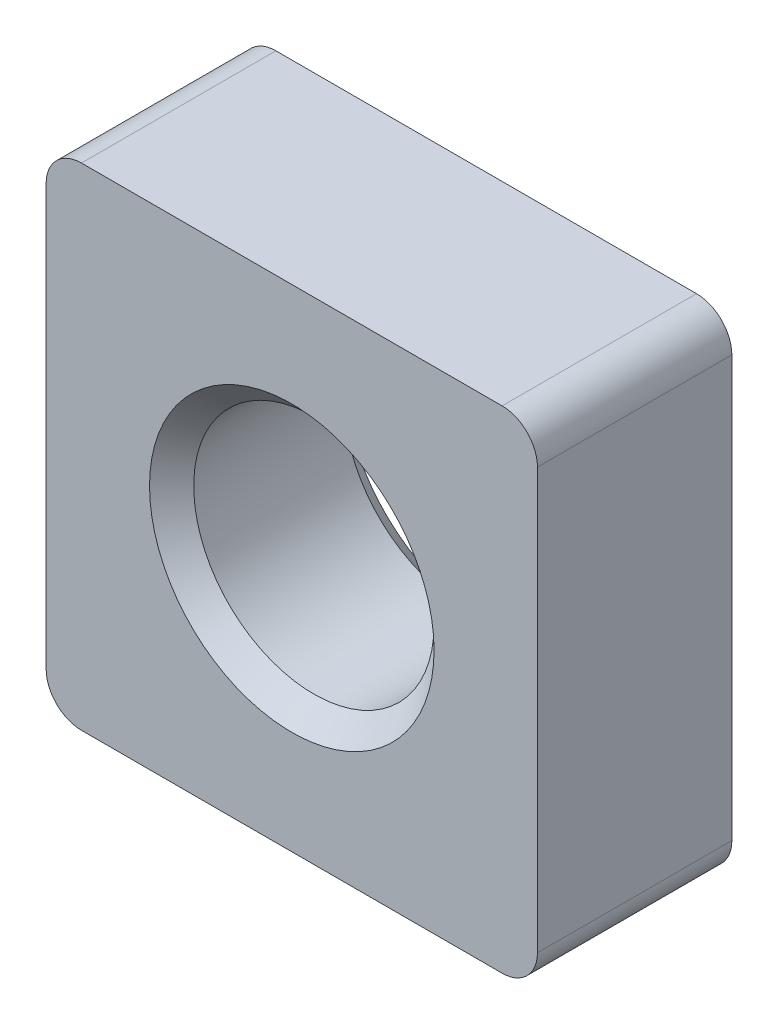
ISO-10303-21;
HEADER;
FILE_DESCRIPTION(('STEP AP214'),'2;1');
FILE_NAME('part.step','',(''),(''),'','','');
FILE_SCHEMA(('AUTOMOTIVE_DESIGN { 1 0 10303 214 1 1 1 1 }'));
ENDSEC;
DATA;
#1=APPLICATION_CONTEXT('core data for automotive mechanical design processes');
#2=APPLICATION_PROTOCOL_DEFINITION('international standard','automotive_design',2000,#1);
#3=PRODUCT_CONTEXT('',#1,'mechanical');
#4=PRODUCT('Part','Part','',(#3));
#5=PRODUCT_RELATED_PRODUCT_CATEGORY('part','',(#4));
#6=PRODUCT_DEFINITION_FORMATION('','',#4);
#7=PRODUCT_DEFINITION_CONTEXT('part definition',#1,'design');
#8=PRODUCT_DEFINITION('design','',#6,#7);
#9=PRODUCT_DEFINITION_SHAPE('','',#8);
#10=(LENGTH_UNIT() NAMED_UNIT(*) SI_UNIT(.MILLI.,.METRE.));
#11=(NAMED_UNIT(*) PLANE_ANGLE_UNIT() SI_UNIT($,.RADIAN.));
#12=(NAMED_UNIT(*) SI_UNIT($,.STERADIAN.) SOLID_ANGLE_UNIT());
#13=UNCERTAINTY_MEASURE_WITH_UNIT(LENGTH_MEASURE(1.E-05),#10,'distance_accuracy_value','');
#14=(GEOMETRIC_REPRESENTATION_CONTEXT(3) GLOBAL_UNCERTAINTY_ASSIGNED_CONTEXT((#13)) GLOBAL_UNIT_ASSIGNED_CONTEXT((#10,
#11,#12)) REPRESENTATION_CONTEXT('',''));
#15=CARTESIAN_POINT('',(0.,0.,0.));
#16=DIRECTION('',(0.,0.,1.));
#17=DIRECTION('',(1.,0.,0.));
#18=AXIS2_PLACEMENT_3D('',#15,#16,#17);
#19=CARTESIAN_POINT('',(6.95,-6.95,5.5));
#20=DIRECTION('',(-1.,0.,0.));
#21=DIRECTION('',(0.,0.,1.));
#22=AXIS2_PLACEMENT_3D('',#19,#20,#21);
#23=PLANE('',#22);
#24=DIRECTION('',(0.,1.,0.));
#25=VECTOR('',#24,1.);
#26=CARTESIAN_POINT('',(6.95,-6.95,0.));
#27=LINE('',#26,#25);
#28=CARTESIAN_POINT('',(6.95,-5.95,0.));
#29=VERTEX_POINT('',#28);
#30=CARTESIAN_POINT('',(6.95,5.95,0.));
#31=VERTEX_POINT('',#30);
#32=EDGE_CURVE('E129',#29,#31,#27,.T.);
#33=ORIENTED_EDGE('',*,*,#32,.T.);
#34=DIRECTION('',(0.,0.,-1.));
#35=VECTOR('',#34,1.);
#36=CARTESIAN_POINT('',(6.95,5.95,5.5));
#37=LINE('',#36,#35);
#38=CARTESIAN_POINT('',(6.95,5.95,5.5));
#39=VERTEX_POINT('',#38);
#40=EDGE_CURVE('E107',#31,#39,#37,.F.);
#41=ORIENTED_EDGE('',*,*,#40,.T.);
#42=DIRECTION('',(0.,1.,0.));
#43=VECTOR('',#42,1.);
#44=CARTESIAN_POINT('',(6.95,-6.95,5.5));
#45=LINE('',#44,#43);
#46=CARTESIAN_POINT('',(6.95,-5.95,5.5));
#47=VERTEX_POINT('',#46);
#48=EDGE_CURVE('E139',#47,#39,#45,.T.);
#49=ORIENTED_EDGE('',*,*,#48,.F.);
#50=DIRECTION('',(0.,0.,-1.));
#51=VECTOR('',#50,1.);
#52=CARTESIAN_POINT('',(6.95,-5.95,5.5));
#53=LINE('',#52,#51);
#54=EDGE_CURVE('E112',#47,#29,#53,.T.);
#55=ORIENTED_EDGE('',*,*,#54,.T.);
#56=EDGE_LOOP('',(#33,#41,#49,#55));
#57=FACE_BOUND('',#56,.T.);
#58=ADVANCED_FACE('F37',(#57),#23,.F.);
#59=CARTESIAN_POINT('',(-6.95,6.95,5.5));
#60=DIRECTION('',(0.,-1.,0.));
#61=DIRECTION('',(0.,0.,-1.));
#62=AXIS2_PLACEMENT_3D('',#59,#60,#61);
#63=PLANE('',#62);
#64=DIRECTION('',(-1.,0.,0.));
#65=VECTOR('',#64,1.);
#66=CARTESIAN_POINT('',(-6.95,6.95,5.5));
#67=LINE('',#66,#65);
#68=CARTESIAN_POINT('',(5.95,6.95,5.5));
#69=VERTEX_POINT('',#68);
#70=CARTESIAN_POINT('',(-5.95,6.95,5.5));
#71=VERTEX_POINT('',#70);
#72=EDGE_CURVE('E122',#69,#71,#67,.T.);
#73=ORIENTED_EDGE('',*,*,#72,.F.);
#74=DIRECTION('',(0.,0.,-1.));
#75=VECTOR('',#74,1.);
#76=CARTESIAN_POINT('',(5.95,6.95,5.5));
#77=LINE('',#76,#75);
#78=CARTESIAN_POINT('',(5.95,6.95,0.));
#79=VERTEX_POINT('',#78);
#80=EDGE_CURVE('E106',#69,#79,#77,.T.);
#81=ORIENTED_EDGE('',*,*,#80,.T.);
#82=DIRECTION('',(-1.,0.,0.));
#83=VECTOR('',#82,1.);
#84=CARTESIAN_POINT('',(-6.95,6.95,0.));
#85=LINE('',#84,#83);
#86=CARTESIAN_POINT('',(-5.95,6.95,0.));
#87=VERTEX_POINT('',#86);
#88=EDGE_CURVE('E119',#79,#87,#85,.T.);
#89=ORIENTED_EDGE('',*,*,#88,.T.);
#90=DIRECTION('',(0.,0.,-1.));
#91=VECTOR('',#90,1.);
#92=CARTESIAN_POINT('',(-5.95,6.95,5.5));
#93=LINE('',#92,#91);
#94=EDGE_CURVE('E124',#87,#71,#93,.F.);
#95=ORIENTED_EDGE('',*,*,#94,.T.);
#96=EDGE_LOOP('',(#73,#81,#89,#95));
#97=FACE_BOUND('',#96,.T.);
#98=ADVANCED_FACE('F118',(#97),#63,.F.);
#99=CARTESIAN_POINT('',(-6.95,-6.95,5.5));
#100=DIRECTION('',(1.,0.,0.));
#101=DIRECTION('',(0.,0.,-1.));
#102=AXIS2_PLACEMENT_3D('',#99,#100,#101);
#103=PLANE('',#102);
#104=DIRECTION('',(0.,-1.,0.));
#105=VECTOR('',#104,1.);
#106=CARTESIAN_POINT('',(-6.95,-6.95,5.5));
#107=LINE('',#106,#105);
#108=CARTESIAN_POINT('',(-6.95,5.95,5.5));
#109=VERTEX_POINT('',#108);
#110=CARTESIAN_POINT('',(-6.95,-5.95,5.5));
#111=VERTEX_POINT('',#110);
#112=EDGE_CURVE('E173',#109,#111,#107,.T.);
#113=ORIENTED_EDGE('',*,*,#112,.F.);
#114=DIRECTION('',(0.,0.,-1.));
#115=VECTOR('',#114,1.);
#116=CARTESIAN_POINT('',(-6.95,5.95,5.5));
#117=LINE('',#116,#115);
#118=CARTESIAN_POINT('',(-6.95,5.95,0.));
#119=VERTEX_POINT('',#118);
#120=EDGE_CURVE('E158',#109,#119,#117,.T.);
#121=ORIENTED_EDGE('',*,*,#120,.T.);
#122=DIRECTION('',(0.,-1.,0.));
#123=VECTOR('',#122,1.);
#124=CARTESIAN_POINT('',(-6.95,-6.95,0.));
#125=LINE('',#124,#123);
#126=CARTESIAN_POINT('',(-6.95,-5.95,0.));
#127=VERTEX_POINT('',#126);
#128=EDGE_CURVE('E128',#119,#127,#125,.T.);
#129=ORIENTED_EDGE('',*,*,#128,.T.);
#130=DIRECTION('',(0.,0.,-1.));
#131=VECTOR('',#130,1.);
#132=CARTESIAN_POINT('',(-6.95,-5.95,5.5));
#133=LINE('',#132,#131);
#134=EDGE_CURVE('E156',#127,#111,#133,.F.);
#135=ORIENTED_EDGE('',*,*,#134,.T.);
#136=EDGE_LOOP('',(#113,#121,#129,#135));
#137=FACE_BOUND('',#136,.T.);
#138=ADVANCED_FACE('F189',(#137),#103,.F.);
#139=CARTESIAN_POINT('',(-6.95,-6.95,5.5));
#140=DIRECTION('',(0.,1.,0.));
#141=DIRECTION('',(0.,0.,1.));
#142=AXIS2_PLACEMENT_3D('',#139,#140,#141);
#143=PLANE('',#142);
#144=DIRECTION('',(1.,0.,0.));
#145=VECTOR('',#144,1.);
#146=CARTESIAN_POINT('',(-6.95,-6.95,0.));
#147=LINE('',#146,#145);
#148=CARTESIAN_POINT('',(-5.95,-6.95,0.));
#149=VERTEX_POINT('',#148);
#150=CARTESIAN_POINT('',(5.95,-6.95,0.));
#151=VERTEX_POINT('',#150);
#152=EDGE_CURVE('E132',#149,#151,#147,.T.);
#153=ORIENTED_EDGE('',*,*,#152,.T.);
#154=DIRECTION('',(0.,0.,-1.));
#155=VECTOR('',#154,1.);
#156=CARTESIAN_POINT('',(5.95,-6.95,5.5));
#157=LINE('',#156,#155);
#158=CARTESIAN_POINT('',(5.95,-6.95,5.5));
#159=VERTEX_POINT('',#158);
#160=EDGE_CURVE('E11',#151,#159,#157,.F.);
#161=ORIENTED_EDGE('',*,*,#160,.T.);
#162=DIRECTION('',(1.,0.,0.));
#163=VECTOR('',#162,1.);
#164=CARTESIAN_POINT('',(-6.95,-6.95,5.5));
#165=LINE('',#164,#163);
#166=CARTESIAN_POINT('',(-5.95,-6.95,5.5));
#167=VERTEX_POINT('',#166);
#168=EDGE_CURVE('E140',#167,#159,#165,.T.);
#169=ORIENTED_EDGE('',*,*,#168,.F.);
#170=DIRECTION('',(0.,0.,-1.));
#171=VECTOR('',#170,1.);
#172=CARTESIAN_POINT('',(-5.95,-6.95,5.5));
#173=LINE('',#172,#171);
#174=EDGE_CURVE('E45',#167,#149,#173,.T.);
#175=ORIENTED_EDGE('',*,*,#174,.T.);
#176=EDGE_LOOP('',(#153,#161,#169,#175));
#177=FACE_BOUND('',#176,.T.);
#178=ADVANCED_FACE('F163',(#177),#143,.F.);
#179=CARTESIAN_POINT('',(0.,0.,5.5));
#180=DIRECTION('',(0.,0.,-1.));
#181=DIRECTION('',(-1.,0.,0.));
#182=AXIS2_PLACEMENT_3D('',#179,#180,#181);
#183=PLANE('',#182);
#184=CARTESIAN_POINT('',(0.,0.,5.5));
#185=DIRECTION('',(0.,0.,1.));
#186=DIRECTION('',(1.,0.,0.));
#187=AXIS2_PLACEMENT_3D('',#184,#185,#186);
#188=CIRCLE('',#187,4.025);
#189=CARTESIAN_POINT('',(4.025,0.,5.5));
#190=VERTEX_POINT('',#189);
#191=EDGE_CURVE('E298',#190,#190,#188,.T.);
#192=ORIENTED_EDGE('',*,*,#191,.F.);
#193=EDGE_LOOP('',(#192));
#194=FACE_BOUND('',#193,.T.);
#195=ORIENTED_EDGE('',*,*,#48,.T.);
#196=CARTESIAN_POINT('',(5.95,5.95,5.5));
#197=DIRECTION('',(0.,0.,-1.));
#198=DIRECTION('',(-1.,0.,0.));
#199=AXIS2_PLACEMENT_3D('',#196,#197,#198);
#200=CIRCLE('',#199,1.);
#201=EDGE_CURVE('E154',#39,#69,#200,.F.);
#202=ORIENTED_EDGE('',*,*,#201,.T.);
#203=ORIENTED_EDGE('',*,*,#72,.T.);
#204=CARTESIAN_POINT('',(-5.95,5.95,5.5));
#205=DIRECTION('',(0.,0.,-1.));
#206=DIRECTION('',(-1.,0.,0.));
#207=AXIS2_PLACEMENT_3D('',#204,#205,#206);
#208=CIRCLE('',#207,1.);
#209=EDGE_CURVE('E152',#71,#109,#208,.F.);
#210=ORIENTED_EDGE('',*,*,#209,.T.);
#211=ORIENTED_EDGE('',*,*,#112,.T.);
#212=CARTESIAN_POINT('',(-5.95,-5.95,5.5));
#213=DIRECTION('',(0.,0.,-1.));
#214=DIRECTION('',(-1.,0.,0.));
#215=AXIS2_PLACEMENT_3D('',#212,#213,#214);
#216=CIRCLE('',#215,1.);
#217=EDGE_CURVE('E57',#111,#167,#216,.F.);
#218=ORIENTED_EDGE('',*,*,#217,.T.);
#219=ORIENTED_EDGE('',*,*,#168,.T.);
#220=CARTESIAN_POINT('',(5.95,-5.95,5.5));
#221=DIRECTION('',(0.,0.,-1.));
#222=DIRECTION('',(-1.,0.,0.));
#223=AXIS2_PLACEMENT_3D('',#220,#221,#222);
#224=CIRCLE('',#223,1.);
#225=EDGE_CURVE('E150',#159,#47,#224,.F.);
#226=ORIENTED_EDGE('',*,*,#225,.T.);
#227=EDGE_LOOP('',(#195,#202,#203,#210,#211,#218,#219,#226));
#228=FACE_BOUND('',#227,.T.);
#229=ADVANCED_FACE('F178',(#194,#228),#183,.F.);
#230=CARTESIAN_POINT('',(0.,0.,0.));
#231=DIRECTION('',(0.,0.,-1.));
#232=DIRECTION('',(-1.,0.,0.));
#233=AXIS2_PLACEMENT_3D('',#230,#231,#232);
#234=PLANE('',#233);
#235=CARTESIAN_POINT('',(0.,0.,0.));
#236=DIRECTION('',(0.,0.,1.));
#237=DIRECTION('',(1.,0.,0.));
#238=AXIS2_PLACEMENT_3D('',#235,#236,#237);
#239=CIRCLE('',#238,4.025);
#240=CARTESIAN_POINT('',(4.025,0.,0.));
#241=VERTEX_POINT('',#240);
#242=EDGE_CURVE('E293',#241,#241,#239,.T.);
#243=ORIENTED_EDGE('',*,*,#242,.T.);
#244=EDGE_LOOP('',(#243));
#245=FACE_BOUND('',#244,.T.);
#246=ORIENTED_EDGE('',*,*,#88,.F.);
#247=CARTESIAN_POINT('',(5.95,5.95,0.));
#248=DIRECTION('',(0.,0.,-1.));
#249=DIRECTION('',(-1.,0.,0.));
#250=AXIS2_PLACEMENT_3D('',#247,#248,#249);
#251=CIRCLE('',#250,1.);
#252=EDGE_CURVE('E102',#79,#31,#251,.T.);
#253=ORIENTED_EDGE('',*,*,#252,.T.);
#254=ORIENTED_EDGE('',*,*,#32,.F.);
#255=CARTESIAN_POINT('',(5.95,-5.95,0.));
#256=DIRECTION('',(0.,0.,-1.));
#257=DIRECTION('',(-1.,0.,0.));
#258=AXIS2_PLACEMENT_3D('',#255,#256,#257);
#259=CIRCLE('',#258,1.);
#260=EDGE_CURVE('E143',#29,#151,#259,.T.);
#261=ORIENTED_EDGE('',*,*,#260,.T.);
#262=ORIENTED_EDGE('',*,*,#152,.F.);
#263=CARTESIAN_POINT('',(-5.95,-5.95,0.));
#264=DIRECTION('',(0.,0.,-1.));
#265=DIRECTION('',(-1.,0.,0.));
#266=AXIS2_PLACEMENT_3D('',#263,#264,#265);
#267=CIRCLE('',#266,1.);
#268=EDGE_CURVE('E123',#149,#127,#267,.T.);
#269=ORIENTED_EDGE('',*,*,#268,.T.);
#270=ORIENTED_EDGE('',*,*,#128,.F.);
#271=CARTESIAN_POINT('',(-5.95,5.95,0.));
#272=DIRECTION('',(0.,0.,-1.));
#273=DIRECTION('',(-1.,0.,0.));
#274=AXIS2_PLACEMENT_3D('',#271,#272,#273);
#275=CIRCLE('',#274,1.);
#276=EDGE_CURVE('E113',#119,#87,#275,.T.);
#277=ORIENTED_EDGE('',*,*,#276,.T.);
#278=EDGE_LOOP('',(#246,#253,#254,#261,#262,#269,#270,#277));
#279=FACE_BOUND('',#278,.T.);
#280=ADVANCED_FACE('F126',(#245,#279),#234,.T.);
#281=CARTESIAN_POINT('',(0.,0.,0.625000000000003));
#282=DIRECTION('',(0.,0.,-1.));
#283=DIRECTION('',(-1.,0.,0.));
#284=AXIS2_PLACEMENT_3D('',#281,#282,#283);
#285=CONICAL_SURFACE('',#284,3.4,0.785398163397447);
#286=ORIENTED_EDGE('',*,*,#242,.F.);
#287=EDGE_LOOP('',(#286));
#288=FACE_BOUND('',#287,.T.);
#289=CARTESIAN_POINT('',(0.,0.,0.625000000000003));
#290=DIRECTION('',(0.,0.,1.));
#291=DIRECTION('',(1.,0.,0.));
#292=AXIS2_PLACEMENT_3D('',#289,#290,#291);
#293=CIRCLE('',#292,3.4);
#294=CARTESIAN_POINT('',(3.4,0.,0.625000000000003));
#295=VERTEX_POINT('',#294);
#296=EDGE_CURVE('E134',#295,#295,#293,.T.);
#297=ORIENTED_EDGE('',*,*,#296,.T.);
#298=EDGE_LOOP('',(#297));
#299=FACE_BOUND('',#298,.T.);
#300=ADVANCED_FACE('F186',(#288,#299),#285,.F.);
#301=CARTESIAN_POINT('',(0.,0.,5.5));
#302=DIRECTION('',(0.,0.,1.));
#303=DIRECTION('',(1.,0.,0.));
#304=AXIS2_PLACEMENT_3D('',#301,#302,#303);
#305=CYLINDRICAL_SURFACE('',#304,3.4);
#306=ORIENTED_EDGE('',*,*,#296,.F.);
#307=EDGE_LOOP('',(#306));
#308=FACE_BOUND('',#307,.T.);
#309=CARTESIAN_POINT('',(0.,0.,4.875));
#310=DIRECTION('',(0.,0.,1.));
#311=DIRECTION('',(1.,0.,0.));
#312=AXIS2_PLACEMENT_3D('',#309,#310,#311);
#313=CIRCLE('',#312,3.4);
#314=CARTESIAN_POINT('',(3.4,0.,4.875));
#315=VERTEX_POINT('',#314);
#316=EDGE_CURVE('E296',#315,#315,#313,.T.);
#317=ORIENTED_EDGE('',*,*,#316,.T.);
#318=EDGE_LOOP('',(#317));
#319=FACE_BOUND('',#318,.T.);
#320=ADVANCED_FACE('F268',(#308,#319),#305,.F.);
#321=CARTESIAN_POINT('',(0.,0.,5.5));
#322=DIRECTION('',(0.,0.,1.));
#323=DIRECTION('',(1.,0.,0.));
#324=AXIS2_PLACEMENT_3D('',#321,#322,#323);
#325=CONICAL_SURFACE('',#324,4.025,0.78539816339745);
#326=ORIENTED_EDGE('',*,*,#316,.F.);
#327=EDGE_LOOP('',(#326));
#328=FACE_BOUND('',#327,.T.);
#329=ORIENTED_EDGE('',*,*,#191,.T.);
#330=EDGE_LOOP('',(#329));
#331=FACE_BOUND('',#330,.T.);
#332=ADVANCED_FACE('F204',(#328,#331),#325,.F.);
#333=CARTESIAN_POINT('',(5.95,5.95,5.5));
#334=DIRECTION('',(0.,0.,-1.));
#335=DIRECTION('',(-1.,0.,0.));
#336=AXIS2_PLACEMENT_3D('',#333,#334,#335);
#337=CYLINDRICAL_SURFACE('',#336,1.);
#338=ORIENTED_EDGE('',*,*,#201,.F.);
#339=ORIENTED_EDGE('',*,*,#40,.F.);
#340=ORIENTED_EDGE('',*,*,#252,.F.);
#341=ORIENTED_EDGE('',*,*,#80,.F.);
#342=EDGE_LOOP('',(#338,#339,#340,#341));
#343=FACE_BOUND('',#342,.T.);
#344=ADVANCED_FACE('F105',(#343),#337,.T.);
#345=CARTESIAN_POINT('',(-5.95,5.95,5.5));
#346=DIRECTION('',(0.,0.,-1.));
#347=DIRECTION('',(-1.,0.,0.));
#348=AXIS2_PLACEMENT_3D('',#345,#346,#347);
#349=CYLINDRICAL_SURFACE('',#348,1.);
#350=ORIENTED_EDGE('',*,*,#209,.F.);
#351=ORIENTED_EDGE('',*,*,#94,.F.);
#352=ORIENTED_EDGE('',*,*,#276,.F.);
#353=ORIENTED_EDGE('',*,*,#120,.F.);
#354=EDGE_LOOP('',(#350,#351,#352,#353));
#355=FACE_BOUND('',#354,.T.);
#356=ADVANCED_FACE('F203',(#355),#349,.T.);
#357=CARTESIAN_POINT('',(5.95,-5.95,5.5));
#358=DIRECTION('',(0.,0.,-1.));
#359=DIRECTION('',(-1.,0.,0.));
#360=AXIS2_PLACEMENT_3D('',#357,#358,#359);
#361=CYLINDRICAL_SURFACE('',#360,1.);
#362=ORIENTED_EDGE('',*,*,#225,.F.);
#363=ORIENTED_EDGE('',*,*,#160,.F.);
#364=ORIENTED_EDGE('',*,*,#260,.F.);
#365=ORIENTED_EDGE('',*,*,#54,.F.);
#366=EDGE_LOOP('',(#362,#363,#364,#365));
#367=FACE_BOUND('',#366,.T.);
#368=ADVANCED_FACE('F168',(#367),#361,.T.);
#369=CARTESIAN_POINT('',(-5.95,-5.95,5.5));
#370=DIRECTION('',(0.,0.,-1.));
#371=DIRECTION('',(-1.,0.,0.));
#372=AXIS2_PLACEMENT_3D('',#369,#370,#371);
#373=CYLINDRICAL_SURFACE('',#372,1.);
#374=ORIENTED_EDGE('',*,*,#217,.F.);
#375=ORIENTED_EDGE('',*,*,#134,.F.);
#376=ORIENTED_EDGE('',*,*,#268,.F.);
#377=ORIENTED_EDGE('',*,*,#174,.F.);
#378=EDGE_LOOP('',(#374,#375,#376,#377));
#379=FACE_BOUND('',#378,.T.);
#380=ADVANCED_FACE('F39',(#379),#373,.T.);
#381=CLOSED_SHELL('',(#58,#98,#138,#178,#229,#280,#300,#320,#332,#344,#356,#368,#380));
#382=MANIFOLD_SOLID_BREP('B2',#381);
#383=ADVANCED_BREP_SHAPE_REPRESENTATION('',(#18,#382),#14);
#384=SHAPE_DEFINITION_REPRESENTATION(#9,#383);
ENDSEC;
END-ISO-10303-21;
